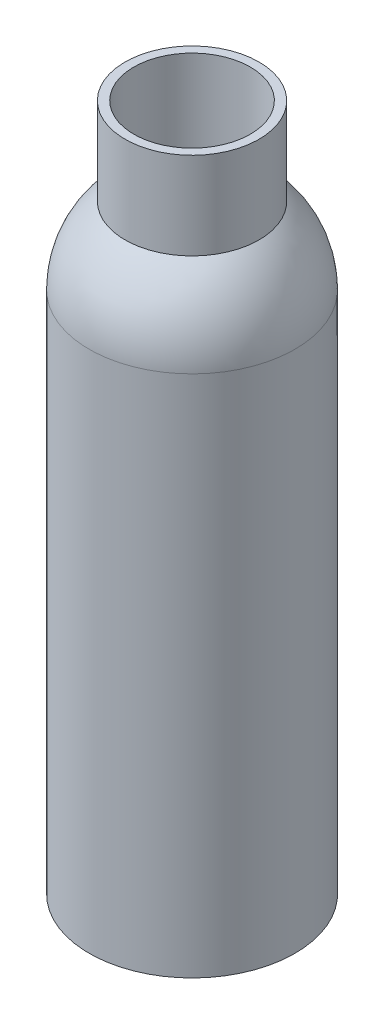
ISO-10303-21;
HEADER;
FILE_DESCRIPTION(('STEP AP214'),'2;1');
FILE_NAME('part.step','',(''),(''),'','','');
FILE_SCHEMA(('AUTOMOTIVE_DESIGN { 1 0 10303 214 1 1 1 1 }'));
ENDSEC;
DATA;
#1=APPLICATION_CONTEXT('core data for automotive mechanical design processes');
#2=APPLICATION_PROTOCOL_DEFINITION('international standard','automotive_design',2000,#1);
#3=PRODUCT_CONTEXT('',#1,'mechanical');
#4=PRODUCT('Part','Part','',(#3));
#5=PRODUCT_RELATED_PRODUCT_CATEGORY('part','',(#4));
#6=PRODUCT_DEFINITION_FORMATION('','',#4);
#7=PRODUCT_DEFINITION_CONTEXT('part definition',#1,'design');
#8=PRODUCT_DEFINITION('design','',#6,#7);
#9=PRODUCT_DEFINITION_SHAPE('','',#8);
#10=(LENGTH_UNIT() NAMED_UNIT(*) SI_UNIT(.MILLI.,.METRE.));
#11=(NAMED_UNIT(*) PLANE_ANGLE_UNIT() SI_UNIT($,.RADIAN.));
#12=(NAMED_UNIT(*) SI_UNIT($,.STERADIAN.) SOLID_ANGLE_UNIT());
#13=UNCERTAINTY_MEASURE_WITH_UNIT(LENGTH_MEASURE(1.E-05),#10,'distance_accuracy_value','');
#14=(GEOMETRIC_REPRESENTATION_CONTEXT(3) GLOBAL_UNCERTAINTY_ASSIGNED_CONTEXT((#13)) GLOBAL_UNIT_ASSIGNED_CONTEXT((#10,
#11,#12)) REPRESENTATION_CONTEXT('',''));
#15=CARTESIAN_POINT('',(0.,0.,0.));
#16=DIRECTION('',(0.,0.,1.));
#17=DIRECTION('',(1.,0.,0.));
#18=AXIS2_PLACEMENT_3D('',#15,#16,#17);
#19=CARTESIAN_POINT('',(0.,3.175,0.));
#20=DIRECTION('',(0.,1.,0.));
#21=DIRECTION('',(0.,0.,1.));
#22=AXIS2_PLACEMENT_3D('',#19,#20,#21);
#23=PLANE('',#22);
#24=CARTESIAN_POINT('',(0.,3.175,0.));
#25=DIRECTION('',(0.,-1.,0.));
#26=DIRECTION('',(0.,0.,-1.));
#27=AXIS2_PLACEMENT_3D('',#24,#25,#26);
#28=CIRCLE('',#27,34.925);
#29=CARTESIAN_POINT('',(0.,3.175,-34.925));
#30=VERTEX_POINT('',#29);
#31=EDGE_CURVE('E10',#30,#30,#28,.T.);
#32=ORIENTED_EDGE('',*,*,#31,.F.);
#33=EDGE_LOOP('',(#32));
#34=FACE_BOUND('',#33,.T.);
#35=ADVANCED_FACE('F32',(#34),#23,.T.);
#36=CARTESIAN_POINT('',(0.,0.,0.));
#37=DIRECTION('',(0.,-1.,0.));
#38=DIRECTION('',(0.,0.,-1.));
#39=AXIS2_PLACEMENT_3D('',#36,#37,#38);
#40=CYLINDRICAL_SURFACE('',#39,34.925);
#41=ORIENTED_EDGE('',*,*,#31,.T.);
#42=EDGE_LOOP('',(#41));
#43=FACE_BOUND('',#42,.T.);
#44=CARTESIAN_POINT('',(0.,187.577306486193,0.));
#45=DIRECTION('',(0.,-1.,0.));
#46=DIRECTION('',(0.,0.,-1.));
#47=AXIS2_PLACEMENT_3D('',#44,#45,#46);
#48=CIRCLE('',#47,34.925);
#49=CARTESIAN_POINT('',(0.,187.577306486193,-34.925));
#50=VERTEX_POINT('',#49);
#51=EDGE_CURVE('E38',#50,#50,#48,.T.);
#52=ORIENTED_EDGE('',*,*,#51,.F.);
#53=EDGE_LOOP('',(#52));
#54=FACE_BOUND('',#53,.T.);
#55=ADVANCED_FACE('F80',(#43,#54),#40,.F.);
#56=CARTESIAN_POINT('',(0.,187.577306486193,0.));
#57=DIRECTION('',(0.,-1.,0.));
#58=DIRECTION('',(0.,0.,-1.));
#59=AXIS2_PLACEMENT_3D('',#56,#57,#58);
#60=DEGENERATE_TOROIDAL_SURFACE('',#59,6.65543551061471,41.5804355106147,.F.);
#61=ORIENTED_EDGE('',*,*,#51,.T.);
#62=EDGE_LOOP('',(#61));
#63=FACE_BOUND('',#62,.T.);
#64=CARTESIAN_POINT('',(0.,218.44,0.));
#65=DIRECTION('',(0.,-1.,0.));
#66=DIRECTION('',(0.,0.,-1.));
#67=AXIS2_PLACEMENT_3D('',#64,#65,#66);
#68=CIRCLE('',#67,21.209);
#69=CARTESIAN_POINT('',(0.,218.44,-21.209));
#70=VERTEX_POINT('',#69);
#71=EDGE_CURVE('E42',#70,#70,#68,.T.);
#72=ORIENTED_EDGE('',*,*,#71,.F.);
#73=EDGE_LOOP('',(#72));
#74=FACE_BOUND('',#73,.T.);
#75=ADVANCED_FACE('F85',(#63,#74),#60,.T.);
#76=CARTESIAN_POINT('',(0.,0.,0.));
#77=DIRECTION('',(0.,-1.,0.));
#78=DIRECTION('',(0.,0.,-1.));
#79=AXIS2_PLACEMENT_3D('',#76,#77,#78);
#80=CYLINDRICAL_SURFACE('',#79,21.209);
#81=ORIENTED_EDGE('',*,*,#71,.T.);
#82=EDGE_LOOP('',(#81));
#83=FACE_BOUND('',#82,.T.);
#84=CARTESIAN_POINT('',(0.,250.19,0.));
#85=DIRECTION('',(0.,-1.,0.));
#86=DIRECTION('',(0.,0.,-1.));
#87=AXIS2_PLACEMENT_3D('',#84,#85,#86);
#88=CIRCLE('',#87,21.209);
#89=CARTESIAN_POINT('',(0.,250.19,-21.209));
#90=VERTEX_POINT('',#89);
#91=EDGE_CURVE('E46',#90,#90,#88,.T.);
#92=ORIENTED_EDGE('',*,*,#91,.F.);
#93=EDGE_LOOP('',(#92));
#94=FACE_BOUND('',#93,.T.);
#95=ADVANCED_FACE('F89',(#83,#94),#80,.F.);
#96=CARTESIAN_POINT('',(24.384,250.19,0.));
#97=DIRECTION('',(0.,1.,0.));
#98=DIRECTION('',(0.,0.,1.));
#99=AXIS2_PLACEMENT_3D('',#96,#97,#98);
#100=PLANE('',#99);
#101=ORIENTED_EDGE('',*,*,#91,.T.);
#102=EDGE_LOOP('',(#101));
#103=FACE_BOUND('',#102,.T.);
#104=CARTESIAN_POINT('',(0.,250.19,0.));
#105=DIRECTION('',(0.,-1.,0.));
#106=DIRECTION('',(0.,0.,-1.));
#107=AXIS2_PLACEMENT_3D('',#104,#105,#106);
#108=CIRCLE('',#107,24.384);
#109=CARTESIAN_POINT('',(0.,250.19,-24.384));
#110=VERTEX_POINT('',#109);
#111=EDGE_CURVE('E51',#110,#110,#108,.T.);
#112=ORIENTED_EDGE('',*,*,#111,.F.);
#113=EDGE_LOOP('',(#112));
#114=FACE_BOUND('',#113,.T.);
#115=ADVANCED_FACE('F95',(#103,#114),#100,.T.);
#116=CARTESIAN_POINT('',(0.,0.,0.));
#117=DIRECTION('',(0.,-1.,0.));
#118=DIRECTION('',(0.,0.,-1.));
#119=AXIS2_PLACEMENT_3D('',#116,#117,#118);
#120=CYLINDRICAL_SURFACE('',#119,24.384);
#121=ORIENTED_EDGE('',*,*,#111,.T.);
#122=EDGE_LOOP('',(#121));
#123=FACE_BOUND('',#122,.T.);
#124=CARTESIAN_POINT('',(0.,218.44,0.));
#125=DIRECTION('',(0.,-1.,0.));
#126=DIRECTION('',(0.,0.,-1.));
#127=AXIS2_PLACEMENT_3D('',#124,#125,#126);
#128=CIRCLE('',#127,24.384);
#129=CARTESIAN_POINT('',(0.,218.44,-24.384));
#130=VERTEX_POINT('',#129);
#131=EDGE_CURVE('E54',#130,#130,#128,.T.);
#132=ORIENTED_EDGE('',*,*,#131,.F.);
#133=EDGE_LOOP('',(#132));
#134=FACE_BOUND('',#133,.T.);
#135=ADVANCED_FACE('F76',(#123,#134),#120,.T.);
#136=CARTESIAN_POINT('',(0.,190.5,0.));
#137=DIRECTION('',(0.,-1.,0.));
#138=DIRECTION('',(0.,0.,-1.));
#139=AXIS2_PLACEMENT_3D('',#136,#137,#138);
#140=DEGENERATE_TOROIDAL_SURFACE('',#139,1.0856650485437,36.3793349514563,.T.);
#141=ORIENTED_EDGE('',*,*,#131,.T.);
#142=EDGE_LOOP('',(#141));
#143=FACE_BOUND('',#142,.T.);
#144=CARTESIAN_POINT('',(0.,190.5,0.));
#145=DIRECTION('',(0.,-1.,0.));
#146=DIRECTION('',(0.,0.,-1.));
#147=AXIS2_PLACEMENT_3D('',#144,#145,#146);
#148=CIRCLE('',#147,37.465);
#149=CARTESIAN_POINT('',(0.,190.5,-37.465));
#150=VERTEX_POINT('',#149);
#151=EDGE_CURVE('E57',#150,#150,#148,.T.);
#152=ORIENTED_EDGE('',*,*,#151,.F.);
#153=EDGE_LOOP('',(#152));
#154=FACE_BOUND('',#153,.T.);
#155=ADVANCED_FACE('F68',(#143,#154),#140,.T.);
#156=CARTESIAN_POINT('',(0.,0.,0.));
#157=DIRECTION('',(0.,-1.,0.));
#158=DIRECTION('',(0.,0.,-1.));
#159=AXIS2_PLACEMENT_3D('',#156,#157,#158);
#160=CYLINDRICAL_SURFACE('',#159,37.465);
#161=ORIENTED_EDGE('',*,*,#151,.T.);
#162=EDGE_LOOP('',(#161));
#163=FACE_BOUND('',#162,.T.);
#164=CARTESIAN_POINT('',(0.,0.,0.));
#165=DIRECTION('',(0.,-1.,0.));
#166=DIRECTION('',(0.,0.,-1.));
#167=AXIS2_PLACEMENT_3D('',#164,#165,#166);
#168=CIRCLE('',#167,37.465);
#169=CARTESIAN_POINT('',(0.,0.,-37.465));
#170=VERTEX_POINT('',#169);
#171=EDGE_CURVE('E60',#170,#170,#168,.T.);
#172=ORIENTED_EDGE('',*,*,#171,.F.);
#173=EDGE_LOOP('',(#172));
#174=FACE_BOUND('',#173,.T.);
#175=ADVANCED_FACE('F66',(#163,#174),#160,.T.);
#176=CARTESIAN_POINT('',(0.,0.,0.));
#177=DIRECTION('',(0.,-1.,0.));
#178=DIRECTION('',(0.,0.,-1.));
#179=AXIS2_PLACEMENT_3D('',#176,#177,#178);
#180=PLANE('',#179);
#181=ORIENTED_EDGE('',*,*,#171,.T.);
#182=EDGE_LOOP('',(#181));
#183=FACE_BOUND('',#182,.T.);
#184=ADVANCED_FACE('F64',(#183),#180,.T.);
#185=CLOSED_SHELL('',(#35,#55,#75,#95,#115,#135,#155,#175,#184));
#186=MANIFOLD_SOLID_BREP('B2',#185);
#187=ADVANCED_BREP_SHAPE_REPRESENTATION('',(#18,#186),#14);
#188=SHAPE_DEFINITION_REPRESENTATION(#9,#187);
ENDSEC;
END-ISO-10303-21;
